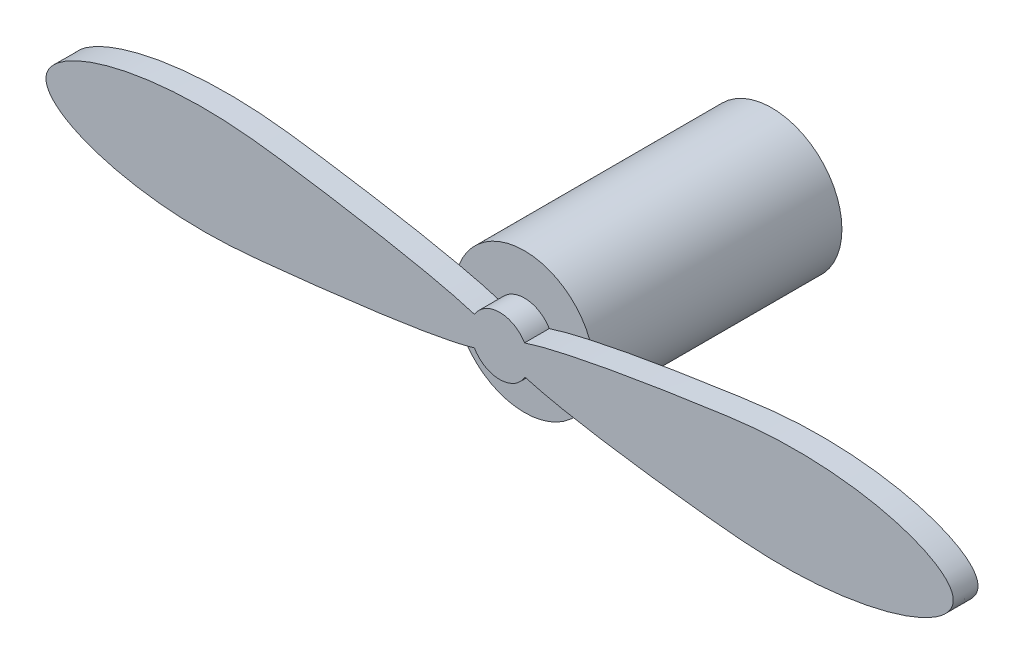
ISO-10303-21;
HEADER;
FILE_DESCRIPTION(('STEP AP214'),'2;1');
FILE_NAME('part.step','',(''),(''),'','','');
FILE_SCHEMA(('AUTOMOTIVE_DESIGN { 1 0 10303 214 1 1 1 1 }'));
ENDSEC;
DATA;
#1=APPLICATION_CONTEXT('core data for automotive mechanical design processes');
#2=APPLICATION_PROTOCOL_DEFINITION('international standard','automotive_design',2000,#1);
#3=PRODUCT_CONTEXT('',#1,'mechanical');
#4=PRODUCT('Part','Part','',(#3));
#5=PRODUCT_RELATED_PRODUCT_CATEGORY('part','',(#4));
#6=PRODUCT_DEFINITION_FORMATION('','',#4);
#7=PRODUCT_DEFINITION_CONTEXT('part definition',#1,'design');
#8=PRODUCT_DEFINITION('design','',#6,#7);
#9=PRODUCT_DEFINITION_SHAPE('','',#8);
#10=(LENGTH_UNIT() NAMED_UNIT(*) SI_UNIT(.MILLI.,.METRE.));
#11=(NAMED_UNIT(*) PLANE_ANGLE_UNIT() SI_UNIT($,.RADIAN.));
#12=(NAMED_UNIT(*) SI_UNIT($,.STERADIAN.) SOLID_ANGLE_UNIT());
#13=UNCERTAINTY_MEASURE_WITH_UNIT(LENGTH_MEASURE(1.E-05),#10,'distance_accuracy_value','');
#14=(GEOMETRIC_REPRESENTATION_CONTEXT(3) GLOBAL_UNCERTAINTY_ASSIGNED_CONTEXT((#13)) GLOBAL_UNIT_ASSIGNED_CONTEXT((#10,
#11,#12)) REPRESENTATION_CONTEXT('',''));
#15=CARTESIAN_POINT('',(0.,0.,0.));
#16=DIRECTION('',(0.,0.,1.));
#17=DIRECTION('',(1.,0.,0.));
#18=AXIS2_PLACEMENT_3D('',#15,#16,#17);
#19=CARTESIAN_POINT('',(0.,0.,15.));
#20=DIRECTION('',(0.,0.,1.));
#21=DIRECTION('',(1.,0.,0.));
#22=AXIS2_PLACEMENT_3D('',#19,#20,#21);
#23=PLANE('',#22);
#24=CARTESIAN_POINT('',(-1.52254453817785,0.891435449262825,15.));
#25=CARTESIAN_POINT('',(-3.69200225366771,1.57674273966907,15.));
#26=CARTESIAN_POINT('',(-9.05449345625781,2.56155393932272,15.));
#27=CARTESIAN_POINT('',(-21.1324167718096,4.23744915191424,15.));
#28=CARTESIAN_POINT('',(-32.4893375533509,0.445121131109934,15.));
#29=CARTESIAN_POINT('',(-22.0279073193443,-3.54227651718357,15.));
#30=CARTESIAN_POINT('',(-10.0012381761596,-2.31393838955299,15.));
#31=CARTESIAN_POINT('',(-3.70361196542928,-1.51896757451245,15.));
#32=CARTESIAN_POINT('',(-1.53370098139856,-0.872101101131996,15.));
#33=B_SPLINE_CURVE_WITH_KNOTS('',3,(#24,#25,#26,#27,#28,#29,#30,#31,#32),.UNSPECIFIED.,.F.,.F.,
(4,1,1,1,1,1,4),(0.,0.157468992909832,0.200426292669715,0.429572997598825,0.660153109240069,
0.703205381512984,0.860095720327973),.UNSPECIFIED.);
#34=CARTESIAN_POINT('',(-1.52254453817785,0.891435449262826,15.));
#35=VERTEX_POINT('',#34);
#36=CARTESIAN_POINT('',(-3.96723581388154,1.52431623918911,15.));
#37=VERTEX_POINT('',#36);
#38=EDGE_CURVE('E46',#35,#37,#33,.T.);
#39=ORIENTED_EDGE('',*,*,#38,.F.);
#40=CARTESIAN_POINT('',(0.,0.,15.));
#41=DIRECTION('',(0.,0.,1.));
#42=DIRECTION('',(1.,0.,0.));
#43=AXIS2_PLACEMENT_3D('',#40,#41,#42);
#44=CIRCLE('',#43,1.76431262279042);
#45=CARTESIAN_POINT('',(1.50837433010629,0.915208124534529,15.));
#46=VERTEX_POINT('',#45);
#47=EDGE_CURVE('E57',#46,#35,#44,.T.);
#48=ORIENTED_EDGE('',*,*,#47,.F.);
#49=CARTESIAN_POINT('',(1.50837433010629,0.91520812453453,15.));
#50=CARTESIAN_POINT('',(3.67404346819113,1.61527321629466,15.));
#51=CARTESIAN_POINT('',(9.04130827284471,2.55535268670922,15.));
#52=CARTESIAN_POINT('',(21.1264346680674,4.24244383944052,15.));
#53=CARTESIAN_POINT('',(32.8276190631507,0.448151772919703,15.));
#54=CARTESIAN_POINT('',(21.2245456415774,-3.55419007933845,15.));
#55=CARTESIAN_POINT('',(9.05218699155349,-2.32824132381189,15.));
#56=CARTESIAN_POINT('',(3.70533143084124,-1.51825592415922,15.));
#57=CARTESIAN_POINT('',(1.53385228447327,-0.871834961649667,15.));
#58=B_SPLINE_CURVE_WITH_KNOTS('',3,(#49,#50,#51,#52,#53,#54,#55,#56,#57),.UNSPECIFIED.,.F.,.F.,
(4,1,1,1,1,1,4),(0.0698910101318439,0.227812068324941,0.270819597560742,0.499966302489853,
0.730546414131097,0.77359845817446,0.930486742923483),.UNSPECIFIED.);
#59=CARTESIAN_POINT('',(3.95678467775168,1.5512430544275,15.));
#60=VERTEX_POINT('',#59);
#61=EDGE_CURVE('E125',#46,#60,#58,.T.);
#62=ORIENTED_EDGE('',*,*,#61,.T.);
#63=CARTESIAN_POINT('',(0.,0.,15.));
#64=DIRECTION('',(0.,0.,1.));
#65=DIRECTION('',(1.,0.,0.));
#66=AXIS2_PLACEMENT_3D('',#63,#64,#65);
#67=CIRCLE('',#66,4.25);
#68=EDGE_CURVE('E120',#60,#37,#67,.T.);
#69=ORIENTED_EDGE('',*,*,#68,.T.);
#70=EDGE_LOOP('',(#39,#48,#62,#69));
#71=FACE_BOUND('',#70,.T.);
#72=ADVANCED_FACE('F35',(#71),#23,.T.);
#73=CARTESIAN_POINT('',(0.,0.,15.));
#74=DIRECTION('',(0.,0.,-1.));
#75=DIRECTION('',(-1.,0.,0.));
#76=AXIS2_PLACEMENT_3D('',#73,#74,#75);
#77=CYLINDRICAL_SURFACE('',#76,4.25);
#78=ORIENTED_EDGE('',*,*,#68,.F.);
#79=CARTESIAN_POINT('',(3.99536926671802,-1.44897357552341,15.));
#80=VERTEX_POINT('',#79);
#81=EDGE_CURVE('E116',#80,#60,#67,.T.);
#82=ORIENTED_EDGE('',*,*,#81,.F.);
#83=CARTESIAN_POINT('',(-4.00586101660762,-1.41971036328661,15.));
#84=VERTEX_POINT('',#83);
#85=EDGE_CURVE('E128',#84,#80,#67,.T.);
#86=ORIENTED_EDGE('',*,*,#85,.F.);
#87=EDGE_CURVE('E121',#37,#84,#67,.T.);
#88=ORIENTED_EDGE('',*,*,#87,.F.);
#89=EDGE_LOOP('',(#78,#82,#86,#88));
#90=FACE_BOUND('',#89,.T.);
#91=CARTESIAN_POINT('',(0.,0.,0.));
#92=DIRECTION('',(0.,0.,1.));
#93=DIRECTION('',(1.,0.,0.));
#94=AXIS2_PLACEMENT_3D('',#91,#92,#93);
#95=CIRCLE('',#94,4.25);
#96=CARTESIAN_POINT('',(4.25,0.,0.));
#97=VERTEX_POINT('',#96);
#98=EDGE_CURVE('E39',#97,#97,#95,.T.);
#99=ORIENTED_EDGE('',*,*,#98,.T.);
#100=EDGE_LOOP('',(#99));
#101=FACE_BOUND('',#100,.T.);
#102=ADVANCED_FACE('F37',(#90,#101),#77,.T.);
#103=CARTESIAN_POINT('',(-1.53370098139833,-0.872101101131863,15.));
#104=VERTEX_POINT('',#103);
#105=EDGE_CURVE('E11',#84,#104,#33,.T.);
#106=ORIENTED_EDGE('',*,*,#105,.F.);
#107=ORIENTED_EDGE('',*,*,#85,.T.);
#108=CARTESIAN_POINT('',(1.53385228447303,-0.871834961649532,15.));
#109=VERTEX_POINT('',#108);
#110=EDGE_CURVE('E44',#80,#109,#58,.T.);
#111=ORIENTED_EDGE('',*,*,#110,.T.);
#112=CARTESIAN_POINT('',(0.,0.,15.));
#113=DIRECTION('',(0.,0.,1.));
#114=DIRECTION('',(1.,0.,0.));
#115=AXIS2_PLACEMENT_3D('',#112,#113,#114);
#116=CIRCLE('',#115,1.76431262279042);
#117=EDGE_CURVE('E143',#104,#109,#116,.T.);
#118=ORIENTED_EDGE('',*,*,#117,.F.);
#119=EDGE_LOOP('',(#106,#107,#111,#118));
#120=FACE_BOUND('',#119,.T.);
#121=ADVANCED_FACE('F137',(#120),#23,.T.);
#122=CARTESIAN_POINT('',(0.,0.,0.));
#123=DIRECTION('',(0.,0.,1.));
#124=DIRECTION('',(1.,0.,0.));
#125=AXIS2_PLACEMENT_3D('',#122,#123,#124);
#126=PLANE('',#125);
#127=ORIENTED_EDGE('',*,*,#98,.F.);
#128=EDGE_LOOP('',(#127));
#129=FACE_BOUND('',#128,.T.);
#130=ADVANCED_FACE('F187',(#129),#126,.F.);
#131=CARTESIAN_POINT('',(0.,0.,15.));
#132=DIRECTION('',(0.,0.,1.));
#133=DIRECTION('',(1.,0.,0.));
#134=AXIS2_PLACEMENT_3D('',#131,#132,#133);
#135=PLANE('',#134);
#136=EDGE_CURVE('E47',#37,#84,#33,.T.);
#137=ORIENTED_EDGE('',*,*,#136,.F.);
#138=ORIENTED_EDGE('',*,*,#87,.T.);
#139=EDGE_LOOP('',(#137,#138));
#140=FACE_BOUND('',#139,.T.);
#141=ADVANCED_FACE('F157',(#140),#135,.F.);
#142=EDGE_CURVE('E126',#60,#80,#58,.T.);
#143=ORIENTED_EDGE('',*,*,#142,.T.);
#144=ORIENTED_EDGE('',*,*,#81,.T.);
#145=EDGE_LOOP('',(#143,#144));
#146=FACE_BOUND('',#145,.T.);
#147=ADVANCED_FACE('F142',(#146),#135,.F.);
#148=CARTESIAN_POINT('',(-1.52254453817785,0.891435449262825,16.5));
#149=CARTESIAN_POINT('',(-3.69200225366771,1.57674273966907,16.5));
#150=CARTESIAN_POINT('',(-9.05449345625781,2.56155393932272,16.5));
#151=CARTESIAN_POINT('',(-21.1324167718096,4.23744915191424,16.5));
#152=CARTESIAN_POINT('',(-32.4893375533509,0.445121131109934,16.5));
#153=CARTESIAN_POINT('',(-22.0279073193443,-3.54227651718357,16.5));
#154=CARTESIAN_POINT('',(-10.0012381761596,-2.31393838955299,16.5));
#155=CARTESIAN_POINT('',(-3.70361196542928,-1.51896757451245,16.5));
#156=CARTESIAN_POINT('',(-1.53370098139856,-0.872101101131996,16.5));
#157=B_SPLINE_CURVE_WITH_KNOTS('',3,(#148,#149,#150,#151,#152,#153,#154,#155,#156),
.UNSPECIFIED.,.F.,.F.,(4,1,1,1,1,1,4),(0.,0.157468992909832,0.200426292669715,0.429572997598825,
0.660153109240069,0.703205381512984,0.860095720327973),.UNSPECIFIED.);
#158=DIRECTION('',(0.,0.,-1.));
#159=VECTOR('',#158,1.);
#160=SURFACE_OF_LINEAR_EXTRUSION('',#157,#159);
#161=ORIENTED_EDGE('',*,*,#38,.T.);
#162=ORIENTED_EDGE('',*,*,#136,.T.);
#163=ORIENTED_EDGE('',*,*,#105,.T.);
#164=DIRECTION('',(0.,0.,-1.));
#165=VECTOR('',#164,1.);
#166=CARTESIAN_POINT('',(-1.53370098139833,-0.872101101131863,16.5));
#167=LINE('',#166,#165);
#168=CARTESIAN_POINT('',(-1.53370098139833,-0.872101101131863,16.5));
#169=VERTEX_POINT('',#168);
#170=EDGE_CURVE('E95',#169,#104,#167,.T.);
#171=ORIENTED_EDGE('',*,*,#170,.F.);
#172=CARTESIAN_POINT('',(-1.52254453817785,0.891435449262826,16.5));
#173=VERTEX_POINT('',#172);
#174=EDGE_CURVE('E102',#173,#169,#157,.T.);
#175=ORIENTED_EDGE('',*,*,#174,.F.);
#176=DIRECTION('',(0.,0.,-1.));
#177=VECTOR('',#176,1.);
#178=CARTESIAN_POINT('',(-1.52254453817785,0.891435449262826,16.5));
#179=LINE('',#178,#177);
#180=EDGE_CURVE('E152',#173,#35,#179,.T.);
#181=ORIENTED_EDGE('',*,*,#180,.T.);
#182=EDGE_LOOP('',(#161,#162,#163,#171,#175,#181));
#183=FACE_BOUND('',#182,.T.);
#184=ADVANCED_FACE('F112',(#183),#160,.F.);
#185=CARTESIAN_POINT('',(0.,0.,16.5));
#186=DIRECTION('',(0.,0.,-1.));
#187=DIRECTION('',(-1.,0.,0.));
#188=AXIS2_PLACEMENT_3D('',#185,#186,#187);
#189=CYLINDRICAL_SURFACE('',#188,1.76431262279042);
#190=ORIENTED_EDGE('',*,*,#117,.T.);
#191=DIRECTION('',(0.,0.,-1.));
#192=VECTOR('',#191,1.);
#193=CARTESIAN_POINT('',(1.53385228447303,-0.871834961649532,16.5));
#194=LINE('',#193,#192);
#195=CARTESIAN_POINT('',(1.53385228447303,-0.871834961649532,16.5));
#196=VERTEX_POINT('',#195);
#197=EDGE_CURVE('E97',#196,#109,#194,.T.);
#198=ORIENTED_EDGE('',*,*,#197,.F.);
#199=CARTESIAN_POINT('',(0.,0.,16.5));
#200=DIRECTION('',(0.,0.,1.));
#201=DIRECTION('',(1.,0.,0.));
#202=AXIS2_PLACEMENT_3D('',#199,#200,#201);
#203=CIRCLE('',#202,1.76431262279042);
#204=EDGE_CURVE('E90',#169,#196,#203,.T.);
#205=ORIENTED_EDGE('',*,*,#204,.F.);
#206=ORIENTED_EDGE('',*,*,#170,.T.);
#207=EDGE_LOOP('',(#190,#198,#205,#206));
#208=FACE_BOUND('',#207,.T.);
#209=ADVANCED_FACE('F93',(#208),#189,.T.);
#210=CARTESIAN_POINT('',(1.50837433010629,0.91520812453453,16.5));
#211=CARTESIAN_POINT('',(3.67404346819113,1.61527321629466,16.5));
#212=CARTESIAN_POINT('',(9.04130827284471,2.55535268670922,16.5));
#213=CARTESIAN_POINT('',(21.1264346680674,4.24244383944052,16.5));
#214=CARTESIAN_POINT('',(32.8276190631507,0.448151772919703,16.5));
#215=CARTESIAN_POINT('',(21.2245456415774,-3.55419007933845,16.5));
#216=CARTESIAN_POINT('',(9.05218699155349,-2.32824132381189,16.5));
#217=CARTESIAN_POINT('',(3.70533143084124,-1.51825592415922,16.5));
#218=CARTESIAN_POINT('',(1.53385228447327,-0.871834961649667,16.5));
#219=B_SPLINE_CURVE_WITH_KNOTS('',3,(#210,#211,#212,#213,#214,#215,#216,#217,#218),
.UNSPECIFIED.,.F.,.F.,(4,1,1,1,1,1,4),(0.0698910101318439,0.227812068324941,0.270819597560742,
0.499966302489853,0.730546414131097,0.77359845817446,0.930486742923483),.UNSPECIFIED.);
#220=DIRECTION('',(0.,0.,-1.));
#221=VECTOR('',#220,1.);
#222=SURFACE_OF_LINEAR_EXTRUSION('',#219,#221);
#223=ORIENTED_EDGE('',*,*,#61,.F.);
#224=DIRECTION('',(0.,0.,-1.));
#225=VECTOR('',#224,1.);
#226=CARTESIAN_POINT('',(1.50837433010629,0.915208124534529,16.5));
#227=LINE('',#226,#225);
#228=CARTESIAN_POINT('',(1.50837433010629,0.915208124534529,16.5));
#229=VERTEX_POINT('',#228);
#230=EDGE_CURVE('E117',#229,#46,#227,.T.);
#231=ORIENTED_EDGE('',*,*,#230,.F.);
#232=EDGE_CURVE('E101',#229,#196,#219,.T.);
#233=ORIENTED_EDGE('',*,*,#232,.T.);
#234=ORIENTED_EDGE('',*,*,#197,.T.);
#235=ORIENTED_EDGE('',*,*,#110,.F.);
#236=ORIENTED_EDGE('',*,*,#142,.F.);
#237=EDGE_LOOP('',(#223,#231,#233,#234,#235,#236));
#238=FACE_BOUND('',#237,.T.);
#239=ADVANCED_FACE('F141',(#238),#222,.T.);
#240=CARTESIAN_POINT('',(0.,0.,16.5));
#241=DIRECTION('',(0.,0.,-1.));
#242=DIRECTION('',(-1.,0.,0.));
#243=AXIS2_PLACEMENT_3D('',#240,#241,#242);
#244=CYLINDRICAL_SURFACE('',#243,1.76431262279042);
#245=ORIENTED_EDGE('',*,*,#47,.T.);
#246=ORIENTED_EDGE('',*,*,#180,.F.);
#247=CARTESIAN_POINT('',(0.,0.,16.5));
#248=DIRECTION('',(0.,0.,1.));
#249=DIRECTION('',(1.,0.,0.));
#250=AXIS2_PLACEMENT_3D('',#247,#248,#249);
#251=CIRCLE('',#250,1.76431262279042);
#252=EDGE_CURVE('E107',#229,#173,#251,.T.);
#253=ORIENTED_EDGE('',*,*,#252,.F.);
#254=ORIENTED_EDGE('',*,*,#230,.T.);
#255=EDGE_LOOP('',(#245,#246,#253,#254));
#256=FACE_BOUND('',#255,.T.);
#257=ADVANCED_FACE('F154',(#256),#244,.T.);
#258=CARTESIAN_POINT('',(0.,0.,16.5));
#259=DIRECTION('',(0.,0.,1.));
#260=DIRECTION('',(1.,0.,0.));
#261=AXIS2_PLACEMENT_3D('',#258,#259,#260);
#262=PLANE('',#261);
#263=ORIENTED_EDGE('',*,*,#174,.T.);
#264=ORIENTED_EDGE('',*,*,#204,.T.);
#265=ORIENTED_EDGE('',*,*,#232,.F.);
#266=ORIENTED_EDGE('',*,*,#252,.T.);
#267=EDGE_LOOP('',(#263,#264,#265,#266));
#268=FACE_BOUND('',#267,.T.);
#269=ADVANCED_FACE('F105',(#268),#262,.T.);
#270=CLOSED_SHELL('',(#72,#102,#121,#130,#141,#147,#184,#209,#239,#257,#269));
#271=MANIFOLD_SOLID_BREP('B2',#270);
#272=ADVANCED_BREP_SHAPE_REPRESENTATION('',(#18,#271),#14);
#273=SHAPE_DEFINITION_REPRESENTATION(#9,#272);
ENDSEC;
END-ISO-10303-21;
